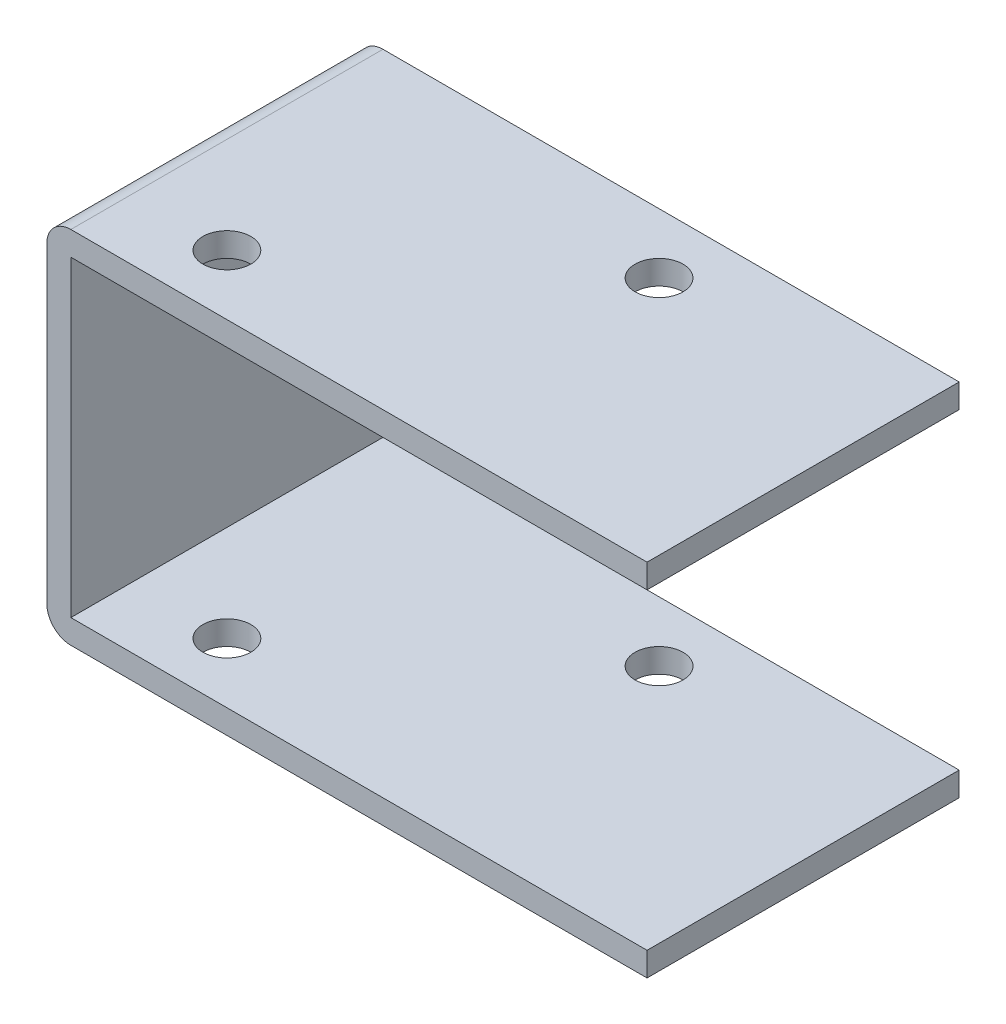
ISO-10303-21;
HEADER;
FILE_DESCRIPTION(('STEP AP214'),'2;1');
FILE_NAME('part.step','',(''),(''),'','','');
FILE_SCHEMA(('AUTOMOTIVE_DESIGN { 1 0 10303 214 1 1 1 1 }'));
ENDSEC;
DATA;
#1=APPLICATION_CONTEXT('core data for automotive mechanical design processes');
#2=APPLICATION_PROTOCOL_DEFINITION('international standard','automotive_design',2000,#1);
#3=PRODUCT_CONTEXT('',#1,'mechanical');
#4=PRODUCT('Part','Part','',(#3));
#5=PRODUCT_RELATED_PRODUCT_CATEGORY('part','',(#4));
#6=PRODUCT_DEFINITION_FORMATION('','',#4);
#7=PRODUCT_DEFINITION_CONTEXT('part definition',#1,'design');
#8=PRODUCT_DEFINITION('design','',#6,#7);
#9=PRODUCT_DEFINITION_SHAPE('','',#8);
#10=(LENGTH_UNIT() NAMED_UNIT(*) SI_UNIT(.MILLI.,.METRE.));
#11=(NAMED_UNIT(*) PLANE_ANGLE_UNIT() SI_UNIT($,.RADIAN.));
#12=(NAMED_UNIT(*) SI_UNIT($,.STERADIAN.) SOLID_ANGLE_UNIT());
#13=UNCERTAINTY_MEASURE_WITH_UNIT(LENGTH_MEASURE(1.E-05),#10,'distance_accuracy_value','');
#14=(GEOMETRIC_REPRESENTATION_CONTEXT(3) GLOBAL_UNCERTAINTY_ASSIGNED_CONTEXT((#13)) GLOBAL_UNIT_ASSIGNED_CONTEXT((#10,
#11,#12)) REPRESENTATION_CONTEXT('',''));
#15=CARTESIAN_POINT('',(0.,0.,0.));
#16=DIRECTION('',(0.,0.,1.));
#17=DIRECTION('',(1.,0.,0.));
#18=AXIS2_PLACEMENT_3D('',#15,#16,#17);
#19=CARTESIAN_POINT('',(-24.,-14.,13.));
#20=DIRECTION('',(0.,0.,-1.));
#21=DIRECTION('',(-1.,0.,0.));
#22=AXIS2_PLACEMENT_3D('',#19,#20,#21);
#23=CYLINDRICAL_SURFACE('',#22,1.);
#24=CARTESIAN_POINT('',(-24.,-14.,0.));
#25=DIRECTION('',(0.,0.,1.));
#26=DIRECTION('',(1.,0.,0.));
#27=AXIS2_PLACEMENT_3D('',#24,#25,#26);
#28=CIRCLE('',#27,1.);
#29=CARTESIAN_POINT('',(-24.,-15.,0.));
#30=VERTEX_POINT('',#29);
#31=CARTESIAN_POINT('',(-25.,-14.,0.));
#32=VERTEX_POINT('',#31);
#33=EDGE_CURVE('E147',#30,#32,#28,.F.);
#34=ORIENTED_EDGE('',*,*,#33,.F.);
#35=DIRECTION('',(0.,0.,-1.));
#36=VECTOR('',#35,1.);
#37=CARTESIAN_POINT('',(-24.,-15.,13.));
#38=LINE('',#37,#36);
#39=CARTESIAN_POINT('',(-24.,-15.,13.));
#40=VERTEX_POINT('',#39);
#41=EDGE_CURVE('E11',#40,#30,#38,.T.);
#42=ORIENTED_EDGE('',*,*,#41,.F.);
#43=CARTESIAN_POINT('',(-24.,-14.,13.));
#44=DIRECTION('',(0.,0.,1.));
#45=DIRECTION('',(1.,0.,0.));
#46=AXIS2_PLACEMENT_3D('',#43,#44,#45);
#47=CIRCLE('',#46,1.);
#48=CARTESIAN_POINT('',(-25.,-14.,13.));
#49=VERTEX_POINT('',#48);
#50=EDGE_CURVE('E183',#40,#49,#47,.F.);
#51=ORIENTED_EDGE('',*,*,#50,.T.);
#52=DIRECTION('',(0.,0.,-1.));
#53=VECTOR('',#52,1.);
#54=CARTESIAN_POINT('',(-25.,-14.,13.));
#55=LINE('',#54,#53);
#56=EDGE_CURVE('E97',#49,#32,#55,.T.);
#57=ORIENTED_EDGE('',*,*,#56,.T.);
#58=EDGE_LOOP('',(#34,#42,#51,#57));
#59=FACE_BOUND('',#58,.T.);
#60=ADVANCED_FACE('F38',(#59),#23,.T.);
#61=CARTESIAN_POINT('',(0.,-15.,13.));
#62=DIRECTION('',(0.,-1.,0.));
#63=DIRECTION('',(1.,0.,0.));
#64=AXIS2_PLACEMENT_3D('',#61,#62,#63);
#65=PLANE('',#64);
#66=CARTESIAN_POINT('',(-20.,-15.,10.5));
#67=DIRECTION('',(0.,1.,0.));
#68=DIRECTION('',(-1.,0.,0.));
#69=AXIS2_PLACEMENT_3D('',#66,#67,#68);
#70=CIRCLE('',#69,1.);
#71=CARTESIAN_POINT('',(-21.,-15.,10.5));
#72=VERTEX_POINT('',#71);
#73=EDGE_CURVE('E269',#72,#72,#70,.T.);
#74=ORIENTED_EDGE('',*,*,#73,.T.);
#75=EDGE_LOOP('',(#74));
#76=FACE_BOUND('',#75,.T.);
#77=CARTESIAN_POINT('',(-10.,-15.,2.5));
#78=DIRECTION('',(0.,1.,0.));
#79=DIRECTION('',(-1.,0.,0.));
#80=AXIS2_PLACEMENT_3D('',#77,#78,#79);
#81=CIRCLE('',#80,1.);
#82=CARTESIAN_POINT('',(-11.,-15.,2.5));
#83=VERTEX_POINT('',#82);
#84=EDGE_CURVE('E257',#83,#83,#81,.T.);
#85=ORIENTED_EDGE('',*,*,#84,.T.);
#86=EDGE_LOOP('',(#85));
#87=FACE_BOUND('',#86,.T.);
#88=DIRECTION('',(-1.,0.,0.));
#89=VECTOR('',#88,1.);
#90=CARTESIAN_POINT('',(0.,-15.,0.));
#91=LINE('',#90,#89);
#92=CARTESIAN_POINT('',(0.,-15.,0.));
#93=VERTEX_POINT('',#92);
#94=EDGE_CURVE('E151',#93,#30,#91,.T.);
#95=ORIENTED_EDGE('',*,*,#94,.F.);
#96=DIRECTION('',(0.,0.,-1.));
#97=VECTOR('',#96,1.);
#98=CARTESIAN_POINT('',(0.,-15.,13.));
#99=LINE('',#98,#97);
#100=CARTESIAN_POINT('',(0.,-15.,13.));
#101=VERTEX_POINT('',#100);
#102=EDGE_CURVE('E48',#101,#93,#99,.T.);
#103=ORIENTED_EDGE('',*,*,#102,.F.);
#104=DIRECTION('',(-1.,0.,0.));
#105=VECTOR('',#104,1.);
#106=CARTESIAN_POINT('',(0.,-15.,13.));
#107=LINE('',#106,#105);
#108=EDGE_CURVE('E226',#101,#40,#107,.T.);
#109=ORIENTED_EDGE('',*,*,#108,.T.);
#110=ORIENTED_EDGE('',*,*,#41,.T.);
#111=EDGE_LOOP('',(#95,#103,#109,#110));
#112=FACE_BOUND('',#111,.T.);
#113=ADVANCED_FACE('F213',(#76,#87,#112),#65,.T.);
#114=CARTESIAN_POINT('',(0.,0.,13.));
#115=DIRECTION('',(1.,0.,0.));
#116=DIRECTION('',(0.,1.,0.));
#117=AXIS2_PLACEMENT_3D('',#114,#115,#116);
#118=PLANE('',#117);
#119=DIRECTION('',(0.,-1.,0.));
#120=VECTOR('',#119,1.);
#121=CARTESIAN_POINT('',(0.,0.,0.));
#122=LINE('',#121,#120);
#123=CARTESIAN_POINT('',(0.,-14.,0.));
#124=VERTEX_POINT('',#123);
#125=EDGE_CURVE('E156',#124,#93,#122,.T.);
#126=ORIENTED_EDGE('',*,*,#125,.F.);
#127=DIRECTION('',(0.,0.,-1.));
#128=VECTOR('',#127,1.);
#129=CARTESIAN_POINT('',(0.,-14.,13.));
#130=LINE('',#129,#128);
#131=CARTESIAN_POINT('',(0.,-14.,13.));
#132=VERTEX_POINT('',#131);
#133=EDGE_CURVE('E199',#132,#124,#130,.T.);
#134=ORIENTED_EDGE('',*,*,#133,.F.);
#135=DIRECTION('',(0.,-1.,0.));
#136=VECTOR('',#135,1.);
#137=CARTESIAN_POINT('',(0.,0.,13.));
#138=LINE('',#137,#136);
#139=EDGE_CURVE('E209',#132,#101,#138,.T.);
#140=ORIENTED_EDGE('',*,*,#139,.T.);
#141=ORIENTED_EDGE('',*,*,#102,.T.);
#142=EDGE_LOOP('',(#126,#134,#140,#141));
#143=FACE_BOUND('',#142,.T.);
#144=ADVANCED_FACE('F207',(#143),#118,.T.);
#145=CARTESIAN_POINT('',(0.,-14.,13.));
#146=DIRECTION('',(0.,1.,0.));
#147=DIRECTION('',(0.,0.,1.));
#148=AXIS2_PLACEMENT_3D('',#145,#146,#147);
#149=PLANE('',#148);
#150=CARTESIAN_POINT('',(-20.,-14.,10.5));
#151=DIRECTION('',(0.,1.,0.));
#152=DIRECTION('',(0.,0.,1.));
#153=AXIS2_PLACEMENT_3D('',#150,#151,#152);
#154=CIRCLE('',#153,1.);
#155=CARTESIAN_POINT('',(-20.,-14.,11.5));
#156=VERTEX_POINT('',#155);
#157=EDGE_CURVE('E261',#156,#156,#154,.T.);
#158=ORIENTED_EDGE('',*,*,#157,.F.);
#159=EDGE_LOOP('',(#158));
#160=FACE_BOUND('',#159,.T.);
#161=CARTESIAN_POINT('',(-10.,-14.,2.5));
#162=DIRECTION('',(0.,1.,0.));
#163=DIRECTION('',(0.,0.,1.));
#164=AXIS2_PLACEMENT_3D('',#161,#162,#163);
#165=CIRCLE('',#164,1.);
#166=CARTESIAN_POINT('',(-10.,-14.,3.5));
#167=VERTEX_POINT('',#166);
#168=EDGE_CURVE('E152',#167,#167,#165,.T.);
#169=ORIENTED_EDGE('',*,*,#168,.F.);
#170=EDGE_LOOP('',(#169));
#171=FACE_BOUND('',#170,.T.);
#172=DIRECTION('',(1.,0.,0.));
#173=VECTOR('',#172,1.);
#174=CARTESIAN_POINT('',(0.,-14.,0.));
#175=LINE('',#174,#173);
#176=CARTESIAN_POINT('',(-24.,-14.,0.));
#177=VERTEX_POINT('',#176);
#178=EDGE_CURVE('E160',#177,#124,#175,.T.);
#179=ORIENTED_EDGE('',*,*,#178,.F.);
#180=DIRECTION('',(0.,0.,-1.));
#181=VECTOR('',#180,1.);
#182=CARTESIAN_POINT('',(-24.,-14.,13.));
#183=LINE('',#182,#181);
#184=CARTESIAN_POINT('',(-24.,-14.,13.));
#185=VERTEX_POINT('',#184);
#186=EDGE_CURVE('E196',#185,#177,#183,.T.);
#187=ORIENTED_EDGE('',*,*,#186,.F.);
#188=DIRECTION('',(1.,0.,0.));
#189=VECTOR('',#188,1.);
#190=CARTESIAN_POINT('',(0.,-14.,13.));
#191=LINE('',#190,#189);
#192=EDGE_CURVE('E223',#185,#132,#191,.T.);
#193=ORIENTED_EDGE('',*,*,#192,.T.);
#194=ORIENTED_EDGE('',*,*,#133,.T.);
#195=EDGE_LOOP('',(#179,#187,#193,#194));
#196=FACE_BOUND('',#195,.T.);
#197=ADVANCED_FACE('F220',(#160,#171,#196),#149,.T.);
#198=CARTESIAN_POINT('',(-24.,0.,13.));
#199=DIRECTION('',(1.,0.,0.));
#200=DIRECTION('',(0.,0.,-1.));
#201=AXIS2_PLACEMENT_3D('',#198,#199,#200);
#202=PLANE('',#201);
#203=DIRECTION('',(0.,-1.,0.));
#204=VECTOR('',#203,1.);
#205=CARTESIAN_POINT('',(-24.,0.,0.));
#206=LINE('',#205,#204);
#207=CARTESIAN_POINT('',(-24.,-1.,0.));
#208=VERTEX_POINT('',#207);
#209=EDGE_CURVE('E164',#208,#177,#206,.T.);
#210=ORIENTED_EDGE('',*,*,#209,.F.);
#211=DIRECTION('',(0.,0.,-1.));
#212=VECTOR('',#211,1.);
#213=CARTESIAN_POINT('',(-24.,-1.,13.));
#214=LINE('',#213,#212);
#215=CARTESIAN_POINT('',(-24.,-1.,13.));
#216=VERTEX_POINT('',#215);
#217=EDGE_CURVE('E193',#216,#208,#214,.T.);
#218=ORIENTED_EDGE('',*,*,#217,.F.);
#219=DIRECTION('',(0.,-1.,0.));
#220=VECTOR('',#219,1.);
#221=CARTESIAN_POINT('',(-24.,0.,13.));
#222=LINE('',#221,#220);
#223=EDGE_CURVE('E231',#216,#185,#222,.T.);
#224=ORIENTED_EDGE('',*,*,#223,.T.);
#225=ORIENTED_EDGE('',*,*,#186,.T.);
#226=EDGE_LOOP('',(#210,#218,#224,#225));
#227=FACE_BOUND('',#226,.T.);
#228=ADVANCED_FACE('F303',(#227),#202,.T.);
#229=CARTESIAN_POINT('',(0.,-1.,13.));
#230=DIRECTION('',(0.,1.,0.));
#231=DIRECTION('',(0.,0.,1.));
#232=AXIS2_PLACEMENT_3D('',#229,#230,#231);
#233=PLANE('',#232);
#234=CARTESIAN_POINT('',(-20.,-0.999999999999999,10.5));
#235=DIRECTION('',(0.,1.,0.));
#236=DIRECTION('',(0.,0.,1.));
#237=AXIS2_PLACEMENT_3D('',#234,#235,#236);
#238=CIRCLE('',#237,1.);
#239=CARTESIAN_POINT('',(-20.,-0.999999999999999,11.5));
#240=VERTEX_POINT('',#239);
#241=EDGE_CURVE('E265',#240,#240,#238,.T.);
#242=ORIENTED_EDGE('',*,*,#241,.T.);
#243=EDGE_LOOP('',(#242));
#244=FACE_BOUND('',#243,.T.);
#245=CARTESIAN_POINT('',(-10.,-1.,2.5));
#246=DIRECTION('',(0.,1.,0.));
#247=DIRECTION('',(0.,0.,1.));
#248=AXIS2_PLACEMENT_3D('',#245,#246,#247);
#249=CIRCLE('',#248,1.);
#250=CARTESIAN_POINT('',(-10.,-1.,3.5));
#251=VERTEX_POINT('',#250);
#252=EDGE_CURVE('E253',#251,#251,#249,.T.);
#253=ORIENTED_EDGE('',*,*,#252,.T.);
#254=EDGE_LOOP('',(#253));
#255=FACE_BOUND('',#254,.T.);
#256=DIRECTION('',(1.,0.,0.));
#257=VECTOR('',#256,1.);
#258=CARTESIAN_POINT('',(0.,-1.,0.));
#259=LINE('',#258,#257);
#260=CARTESIAN_POINT('',(0.,-1.,0.));
#261=VERTEX_POINT('',#260);
#262=EDGE_CURVE('E168',#208,#261,#259,.T.);
#263=ORIENTED_EDGE('',*,*,#262,.T.);
#264=DIRECTION('',(0.,0.,-1.));
#265=VECTOR('',#264,1.);
#266=CARTESIAN_POINT('',(0.,-1.,13.));
#267=LINE('',#266,#265);
#268=CARTESIAN_POINT('',(0.,-1.,13.));
#269=VERTEX_POINT('',#268);
#270=EDGE_CURVE('E190',#269,#261,#267,.T.);
#271=ORIENTED_EDGE('',*,*,#270,.F.);
#272=DIRECTION('',(1.,0.,0.));
#273=VECTOR('',#272,1.);
#274=CARTESIAN_POINT('',(0.,-1.,13.));
#275=LINE('',#274,#273);
#276=EDGE_CURVE('E238',#216,#269,#275,.T.);
#277=ORIENTED_EDGE('',*,*,#276,.F.);
#278=ORIENTED_EDGE('',*,*,#217,.T.);
#279=EDGE_LOOP('',(#263,#271,#277,#278));
#280=FACE_BOUND('',#279,.T.);
#281=ADVANCED_FACE('F307',(#244,#255,#280),#233,.F.);
#282=CARTESIAN_POINT('',(0.,0.,13.));
#283=DIRECTION('',(1.,0.,0.));
#284=DIRECTION('',(0.,0.,-1.));
#285=AXIS2_PLACEMENT_3D('',#282,#283,#284);
#286=PLANE('',#285);
#287=DIRECTION('',(0.,-1.,0.));
#288=VECTOR('',#287,1.);
#289=CARTESIAN_POINT('',(0.,0.,0.));
#290=LINE('',#289,#288);
#291=CARTESIAN_POINT('',(0.,0.,0.));
#292=VERTEX_POINT('',#291);
#293=EDGE_CURVE('E172',#292,#261,#290,.T.);
#294=ORIENTED_EDGE('',*,*,#293,.F.);
#295=DIRECTION('',(0.,0.,-1.));
#296=VECTOR('',#295,1.);
#297=CARTESIAN_POINT('',(0.,0.,13.));
#298=LINE('',#297,#296);
#299=CARTESIAN_POINT('',(0.,0.,13.));
#300=VERTEX_POINT('',#299);
#301=EDGE_CURVE('E137',#300,#292,#298,.T.);
#302=ORIENTED_EDGE('',*,*,#301,.F.);
#303=DIRECTION('',(0.,-1.,0.));
#304=VECTOR('',#303,1.);
#305=CARTESIAN_POINT('',(0.,0.,13.));
#306=LINE('',#305,#304);
#307=EDGE_CURVE('E128',#300,#269,#306,.T.);
#308=ORIENTED_EDGE('',*,*,#307,.T.);
#309=ORIENTED_EDGE('',*,*,#270,.T.);
#310=EDGE_LOOP('',(#294,#302,#308,#309));
#311=FACE_BOUND('',#310,.T.);
#312=ADVANCED_FACE('F243',(#311),#286,.T.);
#313=CARTESIAN_POINT('',(0.,0.,13.));
#314=DIRECTION('',(0.,-1.,0.));
#315=DIRECTION('',(1.,0.,0.));
#316=AXIS2_PLACEMENT_3D('',#313,#314,#315);
#317=PLANE('',#316);
#318=CARTESIAN_POINT('',(-20.,0.,10.5));
#319=DIRECTION('',(0.,1.,0.));
#320=DIRECTION('',(-1.,0.,0.));
#321=AXIS2_PLACEMENT_3D('',#318,#319,#320);
#322=CIRCLE('',#321,1.);
#323=CARTESIAN_POINT('',(-21.,0.,10.5));
#324=VERTEX_POINT('',#323);
#325=EDGE_CURVE('E270',#324,#324,#322,.T.);
#326=ORIENTED_EDGE('',*,*,#325,.F.);
#327=EDGE_LOOP('',(#326));
#328=FACE_BOUND('',#327,.T.);
#329=CARTESIAN_POINT('',(-10.,0.,2.5));
#330=DIRECTION('',(0.,-1.,0.));
#331=DIRECTION('',(1.,0.,0.));
#332=AXIS2_PLACEMENT_3D('',#329,#330,#331);
#333=CIRCLE('',#332,1.);
#334=CARTESIAN_POINT('',(-9.,0.,2.5));
#335=VERTEX_POINT('',#334);
#336=EDGE_CURVE('E41',#335,#335,#333,.T.);
#337=ORIENTED_EDGE('',*,*,#336,.T.);
#338=EDGE_LOOP('',(#337));
#339=FACE_BOUND('',#338,.T.);
#340=DIRECTION('',(-1.,0.,0.));
#341=VECTOR('',#340,1.);
#342=CARTESIAN_POINT('',(0.,0.,0.));
#343=LINE('',#342,#341);
#344=CARTESIAN_POINT('',(-24.,0.,0.));
#345=VERTEX_POINT('',#344);
#346=EDGE_CURVE('E135',#292,#345,#343,.T.);
#347=ORIENTED_EDGE('',*,*,#346,.T.);
#348=DIRECTION('',(0.,0.,-1.));
#349=VECTOR('',#348,1.);
#350=CARTESIAN_POINT('',(-24.,0.,13.));
#351=LINE('',#350,#349);
#352=CARTESIAN_POINT('',(-24.,0.,13.));
#353=VERTEX_POINT('',#352);
#354=EDGE_CURVE('E132',#353,#345,#351,.T.);
#355=ORIENTED_EDGE('',*,*,#354,.F.);
#356=DIRECTION('',(-1.,0.,0.));
#357=VECTOR('',#356,1.);
#358=CARTESIAN_POINT('',(0.,0.,13.));
#359=LINE('',#358,#357);
#360=EDGE_CURVE('E122',#300,#353,#359,.T.);
#361=ORIENTED_EDGE('',*,*,#360,.F.);
#362=ORIENTED_EDGE('',*,*,#301,.T.);
#363=EDGE_LOOP('',(#347,#355,#361,#362));
#364=FACE_BOUND('',#363,.T.);
#365=ADVANCED_FACE('F133',(#328,#339,#364),#317,.F.);
#366=CARTESIAN_POINT('',(-24.,-1.,13.));
#367=DIRECTION('',(0.,0.,-1.));
#368=DIRECTION('',(-1.,0.,0.));
#369=AXIS2_PLACEMENT_3D('',#366,#367,#368);
#370=CYLINDRICAL_SURFACE('',#369,0.999999999999999);
#371=CARTESIAN_POINT('',(-24.,-1.,0.));
#372=DIRECTION('',(0.,0.,1.));
#373=DIRECTION('',(1.,0.,0.));
#374=AXIS2_PLACEMENT_3D('',#371,#372,#373);
#375=CIRCLE('',#374,0.999999999999999);
#376=CARTESIAN_POINT('',(-25.,-1.,0.));
#377=VERTEX_POINT('',#376);
#378=EDGE_CURVE('E90',#345,#377,#375,.T.);
#379=ORIENTED_EDGE('',*,*,#378,.T.);
#380=DIRECTION('',(0.,0.,-1.));
#381=VECTOR('',#380,1.);
#382=CARTESIAN_POINT('',(-25.,-1.,13.));
#383=LINE('',#382,#381);
#384=CARTESIAN_POINT('',(-25.,-1.,13.));
#385=VERTEX_POINT('',#384);
#386=EDGE_CURVE('E138',#385,#377,#383,.T.);
#387=ORIENTED_EDGE('',*,*,#386,.F.);
#388=CARTESIAN_POINT('',(-24.,-1.,13.));
#389=DIRECTION('',(0.,0.,1.));
#390=DIRECTION('',(1.,0.,0.));
#391=AXIS2_PLACEMENT_3D('',#388,#389,#390);
#392=CIRCLE('',#391,0.999999999999999);
#393=EDGE_CURVE('E126',#353,#385,#392,.T.);
#394=ORIENTED_EDGE('',*,*,#393,.F.);
#395=ORIENTED_EDGE('',*,*,#354,.T.);
#396=EDGE_LOOP('',(#379,#387,#394,#395));
#397=FACE_BOUND('',#396,.T.);
#398=ADVANCED_FACE('F140',(#397),#370,.T.);
#399=CARTESIAN_POINT('',(-25.,0.,13.));
#400=DIRECTION('',(1.,0.,0.));
#401=DIRECTION('',(0.,0.,-1.));
#402=AXIS2_PLACEMENT_3D('',#399,#400,#401);
#403=PLANE('',#402);
#404=DIRECTION('',(0.,-1.,0.));
#405=VECTOR('',#404,1.);
#406=CARTESIAN_POINT('',(-25.,0.,0.));
#407=LINE('',#406,#405);
#408=EDGE_CURVE('E180',#377,#32,#407,.T.);
#409=ORIENTED_EDGE('',*,*,#408,.T.);
#410=ORIENTED_EDGE('',*,*,#56,.F.);
#411=DIRECTION('',(0.,-1.,0.));
#412=VECTOR('',#411,1.);
#413=CARTESIAN_POINT('',(-25.,0.,13.));
#414=LINE('',#413,#412);
#415=EDGE_CURVE('E56',#385,#49,#414,.T.);
#416=ORIENTED_EDGE('',*,*,#415,.F.);
#417=ORIENTED_EDGE('',*,*,#386,.T.);
#418=EDGE_LOOP('',(#409,#410,#416,#417));
#419=FACE_BOUND('',#418,.T.);
#420=ADVANCED_FACE('F247',(#419),#403,.F.);
#421=CARTESIAN_POINT('',(0.,0.,13.));
#422=DIRECTION('',(0.,0.,1.));
#423=DIRECTION('',(1.,0.,0.));
#424=AXIS2_PLACEMENT_3D('',#421,#422,#423);
#425=PLANE('',#424);
#426=ORIENTED_EDGE('',*,*,#50,.F.);
#427=ORIENTED_EDGE('',*,*,#108,.F.);
#428=ORIENTED_EDGE('',*,*,#139,.F.);
#429=ORIENTED_EDGE('',*,*,#192,.F.);
#430=ORIENTED_EDGE('',*,*,#223,.F.);
#431=ORIENTED_EDGE('',*,*,#276,.T.);
#432=ORIENTED_EDGE('',*,*,#307,.F.);
#433=ORIENTED_EDGE('',*,*,#360,.T.);
#434=ORIENTED_EDGE('',*,*,#393,.T.);
#435=ORIENTED_EDGE('',*,*,#415,.T.);
#436=EDGE_LOOP('',(#426,#427,#428,#429,#430,#431,#432,#433,#434,#435));
#437=FACE_BOUND('',#436,.T.);
#438=ADVANCED_FACE('F124',(#437),#425,.T.);
#439=CARTESIAN_POINT('',(0.,0.,0.));
#440=DIRECTION('',(0.,0.,1.));
#441=DIRECTION('',(1.,0.,0.));
#442=AXIS2_PLACEMENT_3D('',#439,#440,#441);
#443=PLANE('',#442);
#444=ORIENTED_EDGE('',*,*,#33,.T.);
#445=ORIENTED_EDGE('',*,*,#408,.F.);
#446=ORIENTED_EDGE('',*,*,#378,.F.);
#447=ORIENTED_EDGE('',*,*,#346,.F.);
#448=ORIENTED_EDGE('',*,*,#293,.T.);
#449=ORIENTED_EDGE('',*,*,#262,.F.);
#450=ORIENTED_EDGE('',*,*,#209,.T.);
#451=ORIENTED_EDGE('',*,*,#178,.T.);
#452=ORIENTED_EDGE('',*,*,#125,.T.);
#453=ORIENTED_EDGE('',*,*,#94,.T.);
#454=EDGE_LOOP('',(#444,#445,#446,#447,#448,#449,#450,#451,#452,#453));
#455=FACE_BOUND('',#454,.T.);
#456=ADVANCED_FACE('F215',(#455),#443,.F.);
#457=CARTESIAN_POINT('',(-10.,-15.,2.5));
#458=DIRECTION('',(0.,1.,0.));
#459=DIRECTION('',(-1.,0.,0.));
#460=AXIS2_PLACEMENT_3D('',#457,#458,#459);
#461=CYLINDRICAL_SURFACE('',#460,1.);
#462=ORIENTED_EDGE('',*,*,#336,.F.);
#463=EDGE_LOOP('',(#462));
#464=FACE_BOUND('',#463,.T.);
#465=ORIENTED_EDGE('',*,*,#252,.F.);
#466=EDGE_LOOP('',(#465));
#467=FACE_BOUND('',#466,.T.);
#468=ADVANCED_FACE('F323',(#464,#467),#461,.F.);
#469=ORIENTED_EDGE('',*,*,#168,.T.);
#470=EDGE_LOOP('',(#469));
#471=FACE_BOUND('',#470,.T.);
#472=ORIENTED_EDGE('',*,*,#84,.F.);
#473=EDGE_LOOP('',(#472));
#474=FACE_BOUND('',#473,.T.);
#475=ADVANCED_FACE('F288',(#471,#474),#461,.F.);
#476=CARTESIAN_POINT('',(-20.,-15.,10.5));
#477=DIRECTION('',(0.,1.,0.));
#478=DIRECTION('',(-1.,0.,0.));
#479=AXIS2_PLACEMENT_3D('',#476,#477,#478);
#480=CYLINDRICAL_SURFACE('',#479,1.);
#481=ORIENTED_EDGE('',*,*,#325,.T.);
#482=EDGE_LOOP('',(#481));
#483=FACE_BOUND('',#482,.T.);
#484=ORIENTED_EDGE('',*,*,#241,.F.);
#485=EDGE_LOOP('',(#484));
#486=FACE_BOUND('',#485,.T.);
#487=ADVANCED_FACE('F282',(#483,#486),#480,.F.);
#488=ORIENTED_EDGE('',*,*,#157,.T.);
#489=EDGE_LOOP('',(#488));
#490=FACE_BOUND('',#489,.T.);
#491=ORIENTED_EDGE('',*,*,#73,.F.);
#492=EDGE_LOOP('',(#491));
#493=FACE_BOUND('',#492,.T.);
#494=ADVANCED_FACE('F280',(#490,#493),#480,.F.);
#495=CLOSED_SHELL('',(#60,#113,#144,#197,#228,#281,#312,#365,#398,#420,#438,#456,#468,#475,#487,#494));
#496=MANIFOLD_SOLID_BREP('B2',#495);
#497=ADVANCED_BREP_SHAPE_REPRESENTATION('',(#18,#496),#14);
#498=SHAPE_DEFINITION_REPRESENTATION(#9,#497);
ENDSEC;
END-ISO-10303-21;
